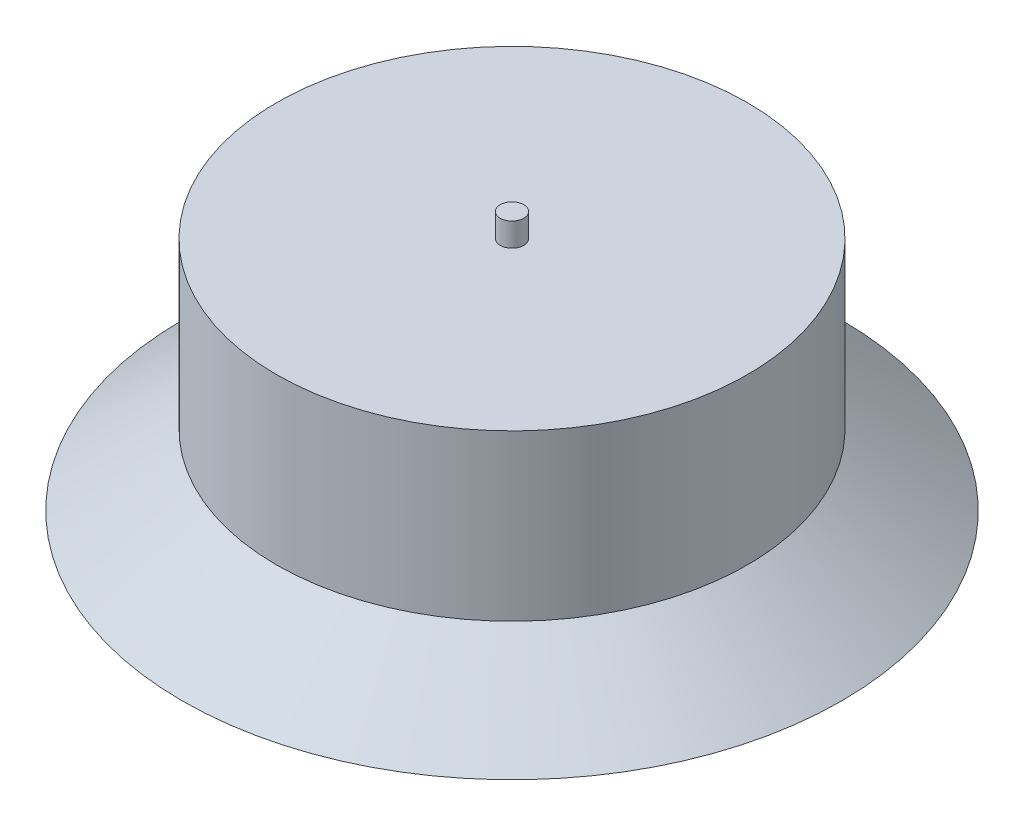
ISO-10303-21;
HEADER;
FILE_DESCRIPTION(('STEP AP214'),'2;1');
FILE_NAME('part.step','',(''),(''),'','','');
FILE_SCHEMA(('AUTOMOTIVE_DESIGN { 1 0 10303 214 1 1 1 1 }'));
ENDSEC;
DATA;
#1=APPLICATION_CONTEXT('core data for automotive mechanical design processes');
#2=APPLICATION_PROTOCOL_DEFINITION('international standard','automotive_design',2000,#1);
#3=PRODUCT_CONTEXT('',#1,'mechanical');
#4=PRODUCT('Part','Part','',(#3));
#5=PRODUCT_RELATED_PRODUCT_CATEGORY('part','',(#4));
#6=PRODUCT_DEFINITION_FORMATION('','',#4);
#7=PRODUCT_DEFINITION_CONTEXT('part definition',#1,'design');
#8=PRODUCT_DEFINITION('design','',#6,#7);
#9=PRODUCT_DEFINITION_SHAPE('','',#8);
#10=(LENGTH_UNIT() NAMED_UNIT(*) SI_UNIT(.MILLI.,.METRE.));
#11=(NAMED_UNIT(*) PLANE_ANGLE_UNIT() SI_UNIT($,.RADIAN.));
#12=(NAMED_UNIT(*) SI_UNIT($,.STERADIAN.) SOLID_ANGLE_UNIT());
#13=UNCERTAINTY_MEASURE_WITH_UNIT(LENGTH_MEASURE(1.E-05),#10,'distance_accuracy_value','');
#14=(GEOMETRIC_REPRESENTATION_CONTEXT(3) GLOBAL_UNCERTAINTY_ASSIGNED_CONTEXT((#13)) GLOBAL_UNIT_ASSIGNED_CONTEXT((#10,
#11,#12)) REPRESENTATION_CONTEXT('',''));
#15=CARTESIAN_POINT('',(0.,0.,0.));
#16=DIRECTION('',(0.,0.,1.));
#17=DIRECTION('',(1.,0.,0.));
#18=AXIS2_PLACEMENT_3D('',#15,#16,#17);
#19=CARTESIAN_POINT('',(0.,100.,0.));
#20=DIRECTION('',(0.,-1.,0.));
#21=DIRECTION('',(0.,0.,-1.));
#22=AXIS2_PLACEMENT_3D('',#19,#20,#21);
#23=CYLINDRICAL_SURFACE('',#22,100.);
#24=CARTESIAN_POINT('',(0.,100.,0.));
#25=DIRECTION('',(0.,1.,0.));
#26=DIRECTION('',(0.,0.,1.));
#27=AXIS2_PLACEMENT_3D('',#24,#25,#26);
#28=CIRCLE('',#27,100.);
#29=CARTESIAN_POINT('',(0.,100.,100.));
#30=VERTEX_POINT('',#29);
#31=EDGE_CURVE('E42',#30,#30,#28,.T.);
#32=ORIENTED_EDGE('',*,*,#31,.F.);
#33=EDGE_LOOP('',(#32));
#34=FACE_BOUND('',#33,.T.);
#35=CARTESIAN_POINT('',(0.,30.,0.));
#36=DIRECTION('',(0.,-1.,0.));
#37=DIRECTION('',(0.,0.,-1.));
#38=AXIS2_PLACEMENT_3D('',#35,#36,#37);
#39=CIRCLE('',#38,100.);
#40=CARTESIAN_POINT('',(0.,30.,-100.));
#41=VERTEX_POINT('',#40);
#42=EDGE_CURVE('E10',#41,#41,#39,.T.);
#43=ORIENTED_EDGE('',*,*,#42,.F.);
#44=EDGE_LOOP('',(#43));
#45=FACE_BOUND('',#44,.T.);
#46=ADVANCED_FACE('F36',(#34,#45),#23,.T.);
#47=CARTESIAN_POINT('',(0.,100.,0.));
#48=DIRECTION('',(0.,1.,0.));
#49=DIRECTION('',(0.,0.,1.));
#50=AXIS2_PLACEMENT_3D('',#47,#48,#49);
#51=PLANE('',#50);
#52=CARTESIAN_POINT('',(0.,100.,0.));
#53=DIRECTION('',(0.,1.,0.));
#54=DIRECTION('',(0.,0.,1.));
#55=AXIS2_PLACEMENT_3D('',#52,#53,#54);
#56=CIRCLE('',#55,5.);
#57=CARTESIAN_POINT('',(0.,100.,5.));
#58=VERTEX_POINT('',#57);
#59=EDGE_CURVE('E53',#58,#58,#56,.T.);
#60=ORIENTED_EDGE('',*,*,#59,.F.);
#61=EDGE_LOOP('',(#60));
#62=FACE_BOUND('',#61,.T.);
#63=ORIENTED_EDGE('',*,*,#31,.T.);
#64=EDGE_LOOP('',(#63));
#65=FACE_BOUND('',#64,.T.);
#66=ADVANCED_FACE('F68',(#62,#65),#51,.T.);
#67=CARTESIAN_POINT('',(0.,30.,0.));
#68=DIRECTION('',(0.,-1.,0.));
#69=DIRECTION('',(0.,0.,-1.));
#70=AXIS2_PLACEMENT_3D('',#67,#68,#69);
#71=CONICAL_SURFACE('',#70,100.,0.927295218001612);
#72=CARTESIAN_POINT('',(0.,0.,0.));
#73=DIRECTION('',(0.,-1.,0.));
#74=DIRECTION('',(0.,0.,-1.));
#75=AXIS2_PLACEMENT_3D('',#72,#73,#74);
#76=CIRCLE('',#75,140.);
#77=CARTESIAN_POINT('',(0.,0.,-140.));
#78=VERTEX_POINT('',#77);
#79=EDGE_CURVE('E46',#78,#78,#76,.T.);
#80=ORIENTED_EDGE('',*,*,#79,.F.);
#81=EDGE_LOOP('',(#80));
#82=FACE_BOUND('',#81,.T.);
#83=ORIENTED_EDGE('',*,*,#42,.T.);
#84=EDGE_LOOP('',(#83));
#85=FACE_BOUND('',#84,.T.);
#86=ADVANCED_FACE('F70',(#82,#85),#71,.T.);
#87=CARTESIAN_POINT('',(0.,0.,0.));
#88=DIRECTION('',(0.,1.,0.));
#89=DIRECTION('',(0.,0.,1.));
#90=AXIS2_PLACEMENT_3D('',#87,#88,#89);
#91=PLANE('',#90);
#92=ORIENTED_EDGE('',*,*,#79,.T.);
#93=EDGE_LOOP('',(#92));
#94=FACE_BOUND('',#93,.T.);
#95=ADVANCED_FACE('F64',(#94),#91,.F.);
#96=CARTESIAN_POINT('',(0.,110.,0.));
#97=DIRECTION('',(0.,-1.,0.));
#98=DIRECTION('',(0.,0.,-1.));
#99=AXIS2_PLACEMENT_3D('',#96,#97,#98);
#100=CYLINDRICAL_SURFACE('',#99,5.);
#101=CARTESIAN_POINT('',(0.,110.,0.));
#102=DIRECTION('',(0.,1.,0.));
#103=DIRECTION('',(0.,0.,1.));
#104=AXIS2_PLACEMENT_3D('',#101,#102,#103);
#105=CIRCLE('',#104,5.);
#106=CARTESIAN_POINT('',(0.,110.,5.));
#107=VERTEX_POINT('',#106);
#108=EDGE_CURVE('E50',#107,#107,#105,.T.);
#109=ORIENTED_EDGE('',*,*,#108,.F.);
#110=EDGE_LOOP('',(#109));
#111=FACE_BOUND('',#110,.T.);
#112=ORIENTED_EDGE('',*,*,#59,.T.);
#113=EDGE_LOOP('',(#112));
#114=FACE_BOUND('',#113,.T.);
#115=ADVANCED_FACE('F61',(#111,#114),#100,.T.);
#116=CARTESIAN_POINT('',(0.,110.,0.));
#117=DIRECTION('',(0.,1.,0.));
#118=DIRECTION('',(0.,0.,1.));
#119=AXIS2_PLACEMENT_3D('',#116,#117,#118);
#120=PLANE('',#119);
#121=ORIENTED_EDGE('',*,*,#108,.T.);
#122=EDGE_LOOP('',(#121));
#123=FACE_BOUND('',#122,.T.);
#124=ADVANCED_FACE('F59',(#123),#120,.T.);
#125=CLOSED_SHELL('',(#46,#66,#86,#95,#115,#124));
#126=MANIFOLD_SOLID_BREP('B2',#125);
#127=ADVANCED_BREP_SHAPE_REPRESENTATION('',(#18,#126),#14);
#128=SHAPE_DEFINITION_REPRESENTATION(#9,#127);
ENDSEC;
END-ISO-10303-21;
